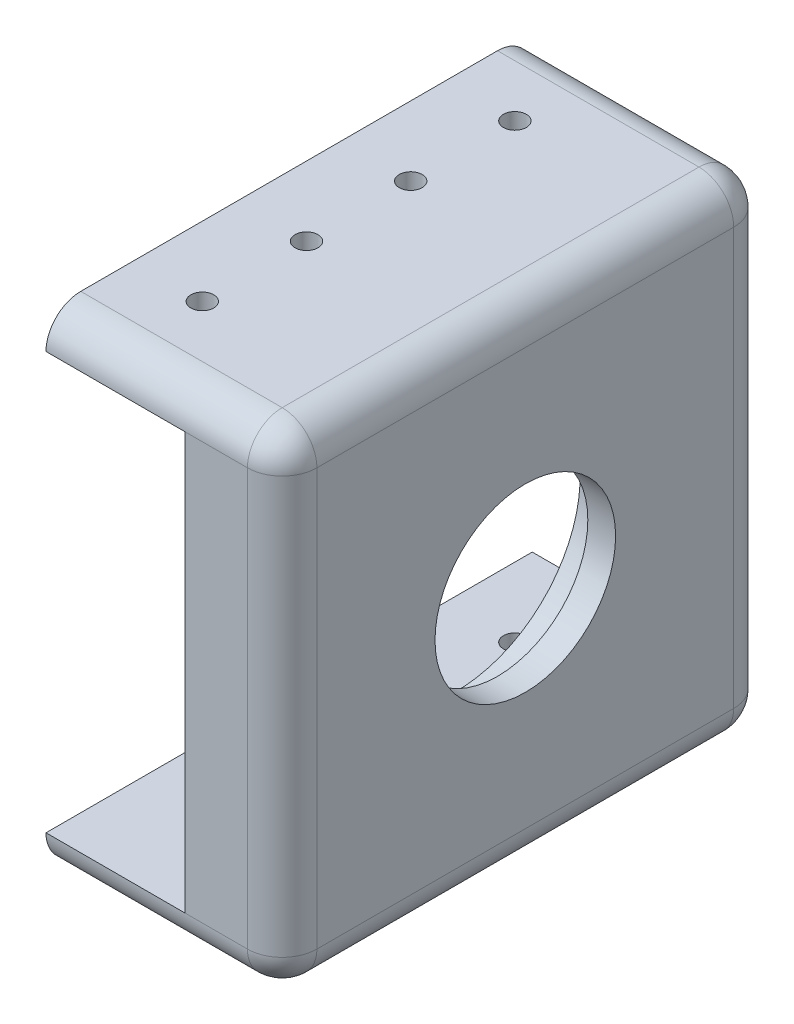
ISO-10303-21;
HEADER;
FILE_DESCRIPTION(('STEP AP214'),'2;1');
FILE_NAME('part.step','',(''),(''),'','','');
FILE_SCHEMA(('AUTOMOTIVE_DESIGN { 1 0 10303 214 1 1 1 1 }'));
ENDSEC;
DATA;
#1=APPLICATION_CONTEXT('core data for automotive mechanical design processes');
#2=APPLICATION_PROTOCOL_DEFINITION('international standard','automotive_design',2000,#1);
#3=PRODUCT_CONTEXT('',#1,'mechanical');
#4=PRODUCT('Part','Part','',(#3));
#5=PRODUCT_RELATED_PRODUCT_CATEGORY('part','',(#4));
#6=PRODUCT_DEFINITION_FORMATION('','',#4);
#7=PRODUCT_DEFINITION_CONTEXT('part definition',#1,'design');
#8=PRODUCT_DEFINITION('design','',#6,#7);
#9=PRODUCT_DEFINITION_SHAPE('','',#8);
#10=(LENGTH_UNIT() NAMED_UNIT(*) SI_UNIT(.MILLI.,.METRE.));
#11=(NAMED_UNIT(*) PLANE_ANGLE_UNIT() SI_UNIT($,.RADIAN.));
#12=(NAMED_UNIT(*) SI_UNIT($,.STERADIAN.) SOLID_ANGLE_UNIT());
#13=UNCERTAINTY_MEASURE_WITH_UNIT(LENGTH_MEASURE(1.E-05),#10,'distance_accuracy_value','');
#14=(GEOMETRIC_REPRESENTATION_CONTEXT(3) GLOBAL_UNCERTAINTY_ASSIGNED_CONTEXT((#13)) GLOBAL_UNIT_ASSIGNED_CONTEXT((#10,
#11,#12)) REPRESENTATION_CONTEXT('',''));
#15=CARTESIAN_POINT('',(0.,0.,0.));
#16=DIRECTION('',(0.,0.,1.));
#17=DIRECTION('',(1.,0.,0.));
#18=AXIS2_PLACEMENT_3D('',#15,#16,#17);
#19=CARTESIAN_POINT('',(30.,0.,35.));
#20=DIRECTION('',(-1.,0.,0.));
#21=DIRECTION('',(0.,0.,1.));
#22=AXIS2_PLACEMENT_3D('',#19,#20,#21);
#23=CYLINDRICAL_SURFACE('',#22,17.5);
#24=CARTESIAN_POINT('',(30.,0.,35.));
#25=DIRECTION('',(-1.,0.,0.));
#26=DIRECTION('',(0.,0.,1.));
#27=AXIS2_PLACEMENT_3D('',#24,#25,#26);
#28=CIRCLE('',#27,17.5);
#29=CARTESIAN_POINT('',(30.,0.,52.5));
#30=VERTEX_POINT('',#29);
#31=EDGE_CURVE('E718',#30,#30,#28,.T.);
#32=ORIENTED_EDGE('',*,*,#31,.F.);
#33=EDGE_LOOP('',(#32));
#34=FACE_BOUND('',#33,.T.);
#35=CARTESIAN_POINT('',(29.,0.,35.));
#36=DIRECTION('',(-1.,0.,0.));
#37=DIRECTION('',(0.,0.,1.));
#38=AXIS2_PLACEMENT_3D('',#35,#36,#37);
#39=CIRCLE('',#38,17.5);
#40=CARTESIAN_POINT('',(29.,0.,52.5));
#41=VERTEX_POINT('',#40);
#42=EDGE_CURVE('E47',#41,#41,#39,.F.);
#43=ORIENTED_EDGE('',*,*,#42,.F.);
#44=EDGE_LOOP('',(#43));
#45=FACE_BOUND('',#44,.T.);
#46=ADVANCED_FACE('F43',(#34,#45),#23,.F.);
#47=CARTESIAN_POINT('',(0.,-35.,70.));
#48=DIRECTION('',(0.,1.,0.));
#49=DIRECTION('',(0.,0.,1.));
#50=AXIS2_PLACEMENT_3D('',#47,#48,#49);
#51=PLANE('',#50);
#52=CARTESIAN_POINT('',(10.,-35.,42.5));
#53=DIRECTION('',(0.,-1.,0.));
#54=DIRECTION('',(0.,0.,-1.));
#55=AXIS2_PLACEMENT_3D('',#52,#53,#54);
#56=CIRCLE('',#55,1.64999999999999);
#57=CARTESIAN_POINT('',(10.,-35.,40.85));
#58=VERTEX_POINT('',#57);
#59=EDGE_CURVE('E751',#58,#58,#56,.T.);
#60=ORIENTED_EDGE('',*,*,#59,.F.);
#61=EDGE_LOOP('',(#60));
#62=FACE_BOUND('',#61,.T.);
#63=CARTESIAN_POINT('',(10.,-35.,57.5));
#64=DIRECTION('',(0.,-1.,0.));
#65=DIRECTION('',(0.,0.,-1.));
#66=AXIS2_PLACEMENT_3D('',#63,#64,#65);
#67=CIRCLE('',#66,1.64999999999999);
#68=CARTESIAN_POINT('',(10.,-35.,55.85));
#69=VERTEX_POINT('',#68);
#70=EDGE_CURVE('E759',#69,#69,#67,.T.);
#71=ORIENTED_EDGE('',*,*,#70,.F.);
#72=EDGE_LOOP('',(#71));
#73=FACE_BOUND('',#72,.T.);
#74=DIRECTION('',(1.,0.,0.));
#75=VECTOR('',#74,1.);
#76=CARTESIAN_POINT('',(0.,-35.,5.));
#77=LINE('',#76,#75);
#78=CARTESIAN_POINT('',(0.,-35.,5.));
#79=VERTEX_POINT('',#78);
#80=CARTESIAN_POINT('',(29.,-35.,5.));
#81=VERTEX_POINT('',#80);
#82=EDGE_CURVE('E147',#79,#81,#77,.T.);
#83=ORIENTED_EDGE('',*,*,#82,.T.);
#84=DIRECTION('',(0.,0.,-1.));
#85=VECTOR('',#84,1.);
#86=CARTESIAN_POINT('',(29.,-35.,70.));
#87=LINE('',#86,#85);
#88=CARTESIAN_POINT('',(29.,-35.,65.));
#89=VERTEX_POINT('',#88);
#90=EDGE_CURVE('E259',#81,#89,#87,.F.);
#91=ORIENTED_EDGE('',*,*,#90,.T.);
#92=DIRECTION('',(1.,0.,0.));
#93=VECTOR('',#92,1.);
#94=CARTESIAN_POINT('',(0.,-35.,65.));
#95=LINE('',#94,#93);
#96=CARTESIAN_POINT('',(0.,-35.,65.));
#97=VERTEX_POINT('',#96);
#98=EDGE_CURVE('E213',#89,#97,#95,.F.);
#99=ORIENTED_EDGE('',*,*,#98,.T.);
#100=DIRECTION('',(0.,0.,-1.));
#101=VECTOR('',#100,1.);
#102=CARTESIAN_POINT('',(0.,-35.,70.));
#103=LINE('',#102,#101);
#104=EDGE_CURVE('E202',#97,#79,#103,.T.);
#105=ORIENTED_EDGE('',*,*,#104,.T.);
#106=EDGE_LOOP('',(#83,#91,#99,#105));
#107=FACE_BOUND('',#106,.T.);
#108=CARTESIAN_POINT('',(10.,-35.,27.5));
#109=DIRECTION('',(0.,-1.,0.));
#110=DIRECTION('',(0.,0.,-1.));
#111=AXIS2_PLACEMENT_3D('',#108,#109,#110);
#112=CIRCLE('',#111,1.64999999999999);
#113=CARTESIAN_POINT('',(10.,-35.,25.85));
#114=VERTEX_POINT('',#113);
#115=EDGE_CURVE('E743',#114,#114,#112,.T.);
#116=ORIENTED_EDGE('',*,*,#115,.F.);
#117=EDGE_LOOP('',(#116));
#118=FACE_BOUND('',#117,.T.);
#119=CARTESIAN_POINT('',(10.,-35.,12.5));
#120=DIRECTION('',(0.,-1.,0.));
#121=DIRECTION('',(0.,0.,-1.));
#122=AXIS2_PLACEMENT_3D('',#119,#120,#121);
#123=CIRCLE('',#122,1.64999999999999);
#124=CARTESIAN_POINT('',(10.,-35.,10.85));
#125=VERTEX_POINT('',#124);
#126=EDGE_CURVE('E732',#125,#125,#123,.T.);
#127=ORIENTED_EDGE('',*,*,#126,.F.);
#128=EDGE_LOOP('',(#127));
#129=FACE_BOUND('',#128,.T.);
#130=ADVANCED_FACE('F349',(#62,#73,#107,#118,#129),#51,.F.);
#131=CARTESIAN_POINT('',(20.,0.,70.));
#132=DIRECTION('',(-1.,0.,0.));
#133=DIRECTION('',(0.,0.,1.));
#134=AXIS2_PLACEMENT_3D('',#131,#132,#133);
#135=PLANE('',#134);
#136=CARTESIAN_POINT('',(20.,0.,35.));
#137=DIRECTION('',(-1.,0.,0.));
#138=DIRECTION('',(0.,0.,1.));
#139=AXIS2_PLACEMENT_3D('',#136,#137,#138);
#140=CIRCLE('',#139,25.);
#141=CARTESIAN_POINT('',(20.,0.,60.));
#142=VERTEX_POINT('',#141);
#143=EDGE_CURVE('E727',#142,#142,#140,.T.);
#144=ORIENTED_EDGE('',*,*,#143,.F.);
#145=EDGE_LOOP('',(#144));
#146=FACE_BOUND('',#145,.T.);
#147=DIRECTION('',(0.,1.,0.));
#148=VECTOR('',#147,1.);
#149=CARTESIAN_POINT('',(20.,0.,0.));
#150=LINE('',#149,#148);
#151=CARTESIAN_POINT('',(20.,-30.,0.));
#152=VERTEX_POINT('',#151);
#153=CARTESIAN_POINT('',(20.,30.,0.));
#154=VERTEX_POINT('',#153);
#155=EDGE_CURVE('E160',#152,#154,#150,.T.);
#156=ORIENTED_EDGE('',*,*,#155,.F.);
#157=DIRECTION('',(0.,0.,-1.));
#158=VECTOR('',#157,1.);
#159=CARTESIAN_POINT('',(20.,-30.,70.));
#160=LINE('',#159,#158);
#161=CARTESIAN_POINT('',(20.,-30.,70.));
#162=VERTEX_POINT('',#161);
#163=EDGE_CURVE('E154',#162,#152,#160,.T.);
#164=ORIENTED_EDGE('',*,*,#163,.F.);
#165=DIRECTION('',(0.,1.,0.));
#166=VECTOR('',#165,1.);
#167=CARTESIAN_POINT('',(20.,0.,70.));
#168=LINE('',#167,#166);
#169=CARTESIAN_POINT('',(20.,30.,70.));
#170=VERTEX_POINT('',#169);
#171=EDGE_CURVE('E157',#162,#170,#168,.T.);
#172=ORIENTED_EDGE('',*,*,#171,.T.);
#173=DIRECTION('',(0.,0.,-1.));
#174=VECTOR('',#173,1.);
#175=CARTESIAN_POINT('',(20.,30.,70.));
#176=LINE('',#175,#174);
#177=EDGE_CURVE('E179',#170,#154,#176,.T.);
#178=ORIENTED_EDGE('',*,*,#177,.T.);
#179=EDGE_LOOP('',(#156,#164,#172,#178));
#180=FACE_BOUND('',#179,.T.);
#181=ADVANCED_FACE('F155',(#146,#180),#135,.T.);
#182=CARTESIAN_POINT('',(0.,-30.,70.));
#183=DIRECTION('',(0.,1.,0.));
#184=DIRECTION('',(0.,0.,1.));
#185=AXIS2_PLACEMENT_3D('',#182,#183,#184);
#186=PLANE('',#185);
#187=CARTESIAN_POINT('',(10.,-30.,12.5));
#188=DIRECTION('',(0.,1.,0.));
#189=DIRECTION('',(0.,0.,1.));
#190=AXIS2_PLACEMENT_3D('',#187,#188,#189);
#191=CIRCLE('',#190,1.64999999999999);
#192=CARTESIAN_POINT('',(10.,-30.,14.15));
#193=VERTEX_POINT('',#192);
#194=EDGE_CURVE('E739',#193,#193,#191,.T.);
#195=ORIENTED_EDGE('',*,*,#194,.F.);
#196=EDGE_LOOP('',(#195));
#197=FACE_BOUND('',#196,.T.);
#198=CARTESIAN_POINT('',(10.,-30.,27.5));
#199=DIRECTION('',(0.,1.,0.));
#200=DIRECTION('',(0.,0.,1.));
#201=AXIS2_PLACEMENT_3D('',#198,#199,#200);
#202=CIRCLE('',#201,1.64999999999999);
#203=CARTESIAN_POINT('',(10.,-30.,29.15));
#204=VERTEX_POINT('',#203);
#205=EDGE_CURVE('E747',#204,#204,#202,.T.);
#206=ORIENTED_EDGE('',*,*,#205,.F.);
#207=EDGE_LOOP('',(#206));
#208=FACE_BOUND('',#207,.T.);
#209=CARTESIAN_POINT('',(10.,-30.,42.5));
#210=DIRECTION('',(0.,1.,0.));
#211=DIRECTION('',(0.,0.,1.));
#212=AXIS2_PLACEMENT_3D('',#209,#210,#211);
#213=CIRCLE('',#212,1.64999999999999);
#214=CARTESIAN_POINT('',(10.,-30.,44.15));
#215=VERTEX_POINT('',#214);
#216=EDGE_CURVE('E755',#215,#215,#213,.T.);
#217=ORIENTED_EDGE('',*,*,#216,.F.);
#218=EDGE_LOOP('',(#217));
#219=FACE_BOUND('',#218,.T.);
#220=CARTESIAN_POINT('',(10.,-30.,57.5));
#221=DIRECTION('',(0.,1.,0.));
#222=DIRECTION('',(0.,0.,1.));
#223=AXIS2_PLACEMENT_3D('',#220,#221,#222);
#224=CIRCLE('',#223,1.64999999999999);
#225=CARTESIAN_POINT('',(10.,-30.,59.15));
#226=VERTEX_POINT('',#225);
#227=EDGE_CURVE('E763',#226,#226,#224,.T.);
#228=ORIENTED_EDGE('',*,*,#227,.F.);
#229=EDGE_LOOP('',(#228));
#230=FACE_BOUND('',#229,.T.);
#231=DIRECTION('',(1.,0.,0.));
#232=VECTOR('',#231,1.);
#233=CARTESIAN_POINT('',(0.,-30.,0.));
#234=LINE('',#233,#232);
#235=CARTESIAN_POINT('',(0.,-30.,0.));
#236=VERTEX_POINT('',#235);
#237=EDGE_CURVE('E185',#236,#152,#234,.T.);
#238=ORIENTED_EDGE('',*,*,#237,.F.);
#239=DIRECTION('',(0.,0.,-1.));
#240=VECTOR('',#239,1.);
#241=CARTESIAN_POINT('',(0.,-30.,70.));
#242=LINE('',#241,#240);
#243=CARTESIAN_POINT('',(0.,-30.,70.));
#244=VERTEX_POINT('',#243);
#245=EDGE_CURVE('E165',#244,#236,#242,.T.);
#246=ORIENTED_EDGE('',*,*,#245,.F.);
#247=DIRECTION('',(1.,0.,0.));
#248=VECTOR('',#247,1.);
#249=CARTESIAN_POINT('',(0.,-30.,70.));
#250=LINE('',#249,#248);
#251=EDGE_CURVE('E140',#244,#162,#250,.T.);
#252=ORIENTED_EDGE('',*,*,#251,.T.);
#253=ORIENTED_EDGE('',*,*,#163,.T.);
#254=EDGE_LOOP('',(#238,#246,#252,#253));
#255=FACE_BOUND('',#254,.T.);
#256=ADVANCED_FACE('F174',(#197,#208,#219,#230,#255),#186,.T.);
#257=CARTESIAN_POINT('',(0.,0.,70.));
#258=DIRECTION('',(-1.,0.,0.));
#259=DIRECTION('',(0.,0.,1.));
#260=AXIS2_PLACEMENT_3D('',#257,#258,#259);
#261=PLANE('',#260);
#262=ORIENTED_EDGE('',*,*,#104,.F.);
#263=CARTESIAN_POINT('',(0.,-30.,65.));
#264=DIRECTION('',(-1.,0.,0.));
#265=DIRECTION('',(0.,0.,1.));
#266=AXIS2_PLACEMENT_3D('',#263,#264,#265);
#267=CIRCLE('',#266,5.);
#268=EDGE_CURVE('E219',#97,#244,#267,.T.);
#269=ORIENTED_EDGE('',*,*,#268,.T.);
#270=ORIENTED_EDGE('',*,*,#245,.T.);
#271=CARTESIAN_POINT('',(0.,-30.,5.));
#272=DIRECTION('',(-1.,0.,0.));
#273=DIRECTION('',(0.,0.,1.));
#274=AXIS2_PLACEMENT_3D('',#271,#272,#273);
#275=CIRCLE('',#274,5.);
#276=EDGE_CURVE('E216',#236,#79,#275,.T.);
#277=ORIENTED_EDGE('',*,*,#276,.T.);
#278=EDGE_LOOP('',(#262,#269,#270,#277));
#279=FACE_BOUND('',#278,.T.);
#280=ADVANCED_FACE('F433',(#279),#261,.T.);
#281=CARTESIAN_POINT('',(34.,0.,70.));
#282=DIRECTION('',(-1.,0.,0.));
#283=DIRECTION('',(0.,0.,1.));
#284=AXIS2_PLACEMENT_3D('',#281,#282,#283);
#285=PLANE('',#284);
#286=CARTESIAN_POINT('',(34.,0.,35.));
#287=DIRECTION('',(-1.,0.,0.));
#288=DIRECTION('',(0.,0.,1.));
#289=AXIS2_PLACEMENT_3D('',#286,#287,#288);
#290=CIRCLE('',#289,13.);
#291=CARTESIAN_POINT('',(34.,0.,48.));
#292=VERTEX_POINT('',#291);
#293=EDGE_CURVE('E712',#292,#292,#290,.T.);
#294=ORIENTED_EDGE('',*,*,#293,.T.);
#295=EDGE_LOOP('',(#294));
#296=FACE_BOUND('',#295,.T.);
#297=DIRECTION('',(0.,1.,0.));
#298=VECTOR('',#297,1.);
#299=CARTESIAN_POINT('',(34.,-30.,65.));
#300=LINE('',#299,#298);
#301=CARTESIAN_POINT('',(34.,30.,65.));
#302=VERTEX_POINT('',#301);
#303=CARTESIAN_POINT('',(34.,-30.,65.));
#304=VERTEX_POINT('',#303);
#305=EDGE_CURVE('E252',#302,#304,#300,.F.);
#306=ORIENTED_EDGE('',*,*,#305,.T.);
#307=DIRECTION('',(0.,0.,-1.));
#308=VECTOR('',#307,1.);
#309=CARTESIAN_POINT('',(34.,-30.,70.));
#310=LINE('',#309,#308);
#311=CARTESIAN_POINT('',(34.,-30.,5.));
#312=VERTEX_POINT('',#311);
#313=EDGE_CURVE('E255',#304,#312,#310,.T.);
#314=ORIENTED_EDGE('',*,*,#313,.T.);
#315=DIRECTION('',(0.,1.,0.));
#316=VECTOR('',#315,1.);
#317=CARTESIAN_POINT('',(34.,0.,5.));
#318=LINE('',#317,#316);
#319=CARTESIAN_POINT('',(34.,30.,5.));
#320=VERTEX_POINT('',#319);
#321=EDGE_CURVE('E249',#312,#320,#318,.T.);
#322=ORIENTED_EDGE('',*,*,#321,.T.);
#323=DIRECTION('',(0.,0.,-1.));
#324=VECTOR('',#323,1.);
#325=CARTESIAN_POINT('',(34.,30.,65.));
#326=LINE('',#325,#324);
#327=EDGE_CURVE('E246',#320,#302,#326,.F.);
#328=ORIENTED_EDGE('',*,*,#327,.T.);
#329=EDGE_LOOP('',(#306,#314,#322,#328));
#330=FACE_BOUND('',#329,.T.);
#331=ADVANCED_FACE('F344',(#296,#330),#285,.F.);
#332=CARTESIAN_POINT('',(0.,35.,70.));
#333=DIRECTION('',(0.,1.,0.));
#334=DIRECTION('',(0.,0.,1.));
#335=AXIS2_PLACEMENT_3D('',#332,#333,#334);
#336=PLANE('',#335);
#337=CARTESIAN_POINT('',(10.,35.,12.5));
#338=DIRECTION('',(0.,1.,0.));
#339=DIRECTION('',(0.,0.,1.));
#340=AXIS2_PLACEMENT_3D('',#337,#338,#339);
#341=CIRCLE('',#340,1.64999999999999);
#342=CARTESIAN_POINT('',(10.,35.,14.15));
#343=VERTEX_POINT('',#342);
#344=EDGE_CURVE('E767',#343,#343,#341,.T.);
#345=ORIENTED_EDGE('',*,*,#344,.F.);
#346=EDGE_LOOP('',(#345));
#347=FACE_BOUND('',#346,.T.);
#348=CARTESIAN_POINT('',(10.,35.,27.5));
#349=DIRECTION('',(0.,1.,0.));
#350=DIRECTION('',(0.,0.,1.));
#351=AXIS2_PLACEMENT_3D('',#348,#349,#350);
#352=CIRCLE('',#351,1.64999999999999);
#353=CARTESIAN_POINT('',(10.,35.,29.15));
#354=VERTEX_POINT('',#353);
#355=EDGE_CURVE('E775',#354,#354,#352,.T.);
#356=ORIENTED_EDGE('',*,*,#355,.F.);
#357=EDGE_LOOP('',(#356));
#358=FACE_BOUND('',#357,.T.);
#359=CARTESIAN_POINT('',(10.,35.,42.5));
#360=DIRECTION('',(0.,1.,0.));
#361=DIRECTION('',(0.,0.,1.));
#362=AXIS2_PLACEMENT_3D('',#359,#360,#361);
#363=CIRCLE('',#362,1.64999999999999);
#364=CARTESIAN_POINT('',(10.,35.,44.15));
#365=VERTEX_POINT('',#364);
#366=EDGE_CURVE('E783',#365,#365,#363,.T.);
#367=ORIENTED_EDGE('',*,*,#366,.F.);
#368=EDGE_LOOP('',(#367));
#369=FACE_BOUND('',#368,.T.);
#370=CARTESIAN_POINT('',(10.,35.,57.5));
#371=DIRECTION('',(0.,1.,0.));
#372=DIRECTION('',(0.,0.,1.));
#373=AXIS2_PLACEMENT_3D('',#370,#371,#372);
#374=CIRCLE('',#373,1.64999999999999);
#375=CARTESIAN_POINT('',(10.,35.,59.15));
#376=VERTEX_POINT('',#375);
#377=EDGE_CURVE('E791',#376,#376,#374,.T.);
#378=ORIENTED_EDGE('',*,*,#377,.F.);
#379=EDGE_LOOP('',(#378));
#380=FACE_BOUND('',#379,.T.);
#381=DIRECTION('',(1.,0.,0.));
#382=VECTOR('',#381,1.);
#383=CARTESIAN_POINT('',(0.,35.,65.));
#384=LINE('',#383,#382);
#385=CARTESIAN_POINT('',(0.,35.,65.));
#386=VERTEX_POINT('',#385);
#387=CARTESIAN_POINT('',(29.,35.,65.));
#388=VERTEX_POINT('',#387);
#389=EDGE_CURVE('E228',#386,#388,#384,.T.);
#390=ORIENTED_EDGE('',*,*,#389,.T.);
#391=DIRECTION('',(0.,0.,-1.));
#392=VECTOR('',#391,1.);
#393=CARTESIAN_POINT('',(29.,35.,5.));
#394=LINE('',#393,#392);
#395=CARTESIAN_POINT('',(29.,35.,5.));
#396=VERTEX_POINT('',#395);
#397=EDGE_CURVE('E11',#388,#396,#394,.T.);
#398=ORIENTED_EDGE('',*,*,#397,.T.);
#399=DIRECTION('',(1.,0.,0.));
#400=VECTOR('',#399,1.);
#401=CARTESIAN_POINT('',(0.,35.,5.));
#402=LINE('',#401,#400);
#403=CARTESIAN_POINT('',(0.,35.,5.));
#404=VERTEX_POINT('',#403);
#405=EDGE_CURVE('E231',#396,#404,#402,.F.);
#406=ORIENTED_EDGE('',*,*,#405,.T.);
#407=DIRECTION('',(0.,0.,-1.));
#408=VECTOR('',#407,1.);
#409=CARTESIAN_POINT('',(0.,35.,70.));
#410=LINE('',#409,#408);
#411=EDGE_CURVE('E198',#386,#404,#410,.T.);
#412=ORIENTED_EDGE('',*,*,#411,.F.);
#413=EDGE_LOOP('',(#390,#398,#406,#412));
#414=FACE_BOUND('',#413,.T.);
#415=ADVANCED_FACE('F313',(#347,#358,#369,#380,#414),#336,.T.);
#416=ORIENTED_EDGE('',*,*,#411,.T.);
#417=CARTESIAN_POINT('',(0.,30.,5.));
#418=DIRECTION('',(-1.,0.,0.));
#419=DIRECTION('',(0.,0.,1.));
#420=AXIS2_PLACEMENT_3D('',#417,#418,#419);
#421=CIRCLE('',#420,5.);
#422=CARTESIAN_POINT('',(0.,30.,0.));
#423=VERTEX_POINT('',#422);
#424=EDGE_CURVE('E237',#404,#423,#421,.T.);
#425=ORIENTED_EDGE('',*,*,#424,.T.);
#426=DIRECTION('',(0.,0.,-1.));
#427=VECTOR('',#426,1.);
#428=CARTESIAN_POINT('',(0.,30.,70.));
#429=LINE('',#428,#427);
#430=CARTESIAN_POINT('',(0.,30.,70.));
#431=VERTEX_POINT('',#430);
#432=EDGE_CURVE('E194',#431,#423,#429,.T.);
#433=ORIENTED_EDGE('',*,*,#432,.F.);
#434=CARTESIAN_POINT('',(0.,30.,65.));
#435=DIRECTION('',(-1.,0.,0.));
#436=DIRECTION('',(0.,0.,1.));
#437=AXIS2_PLACEMENT_3D('',#434,#435,#436);
#438=CIRCLE('',#437,5.);
#439=EDGE_CURVE('E234',#431,#386,#438,.T.);
#440=ORIENTED_EDGE('',*,*,#439,.T.);
#441=EDGE_LOOP('',(#416,#425,#433,#440));
#442=FACE_BOUND('',#441,.T.);
#443=ADVANCED_FACE('F316',(#442),#261,.T.);
#444=CARTESIAN_POINT('',(0.,30.,70.));
#445=DIRECTION('',(0.,1.,0.));
#446=DIRECTION('',(0.,0.,1.));
#447=AXIS2_PLACEMENT_3D('',#444,#445,#446);
#448=PLANE('',#447);
#449=CARTESIAN_POINT('',(10.,30.,12.5));
#450=DIRECTION('',(0.,1.,0.));
#451=DIRECTION('',(0.,0.,1.));
#452=AXIS2_PLACEMENT_3D('',#449,#450,#451);
#453=CIRCLE('',#452,1.64999999999999);
#454=CARTESIAN_POINT('',(10.,30.,14.15));
#455=VERTEX_POINT('',#454);
#456=EDGE_CURVE('E771',#455,#455,#453,.T.);
#457=ORIENTED_EDGE('',*,*,#456,.T.);
#458=EDGE_LOOP('',(#457));
#459=FACE_BOUND('',#458,.T.);
#460=CARTESIAN_POINT('',(10.,30.,27.5));
#461=DIRECTION('',(0.,1.,0.));
#462=DIRECTION('',(0.,0.,1.));
#463=AXIS2_PLACEMENT_3D('',#460,#461,#462);
#464=CIRCLE('',#463,1.64999999999999);
#465=CARTESIAN_POINT('',(10.,30.,29.15));
#466=VERTEX_POINT('',#465);
#467=EDGE_CURVE('E779',#466,#466,#464,.T.);
#468=ORIENTED_EDGE('',*,*,#467,.T.);
#469=EDGE_LOOP('',(#468));
#470=FACE_BOUND('',#469,.T.);
#471=CARTESIAN_POINT('',(10.,30.,42.5));
#472=DIRECTION('',(0.,1.,0.));
#473=DIRECTION('',(0.,0.,1.));
#474=AXIS2_PLACEMENT_3D('',#471,#472,#473);
#475=CIRCLE('',#474,1.64999999999999);
#476=CARTESIAN_POINT('',(10.,30.,44.15));
#477=VERTEX_POINT('',#476);
#478=EDGE_CURVE('E787',#477,#477,#475,.T.);
#479=ORIENTED_EDGE('',*,*,#478,.T.);
#480=EDGE_LOOP('',(#479));
#481=FACE_BOUND('',#480,.T.);
#482=CARTESIAN_POINT('',(10.,30.,57.5));
#483=DIRECTION('',(0.,1.,0.));
#484=DIRECTION('',(0.,0.,1.));
#485=AXIS2_PLACEMENT_3D('',#482,#483,#484);
#486=CIRCLE('',#485,1.64999999999999);
#487=CARTESIAN_POINT('',(10.,30.,59.15));
#488=VERTEX_POINT('',#487);
#489=EDGE_CURVE('E276',#488,#488,#486,.T.);
#490=ORIENTED_EDGE('',*,*,#489,.T.);
#491=EDGE_LOOP('',(#490));
#492=FACE_BOUND('',#491,.T.);
#493=DIRECTION('',(1.,0.,0.));
#494=VECTOR('',#493,1.);
#495=CARTESIAN_POINT('',(0.,30.,0.));
#496=LINE('',#495,#494);
#497=EDGE_CURVE('E171',#423,#154,#496,.T.);
#498=ORIENTED_EDGE('',*,*,#497,.T.);
#499=ORIENTED_EDGE('',*,*,#177,.F.);
#500=DIRECTION('',(1.,0.,0.));
#501=VECTOR('',#500,1.);
#502=CARTESIAN_POINT('',(0.,30.,70.));
#503=LINE('',#502,#501);
#504=EDGE_CURVE('E176',#431,#170,#503,.T.);
#505=ORIENTED_EDGE('',*,*,#504,.F.);
#506=ORIENTED_EDGE('',*,*,#432,.T.);
#507=EDGE_LOOP('',(#498,#499,#505,#506));
#508=FACE_BOUND('',#507,.T.);
#509=ADVANCED_FACE('F321',(#459,#470,#481,#492,#508),#448,.F.);
#510=CARTESIAN_POINT('',(0.,0.,70.));
#511=DIRECTION('',(0.,0.,1.));
#512=DIRECTION('',(1.,0.,0.));
#513=AXIS2_PLACEMENT_3D('',#510,#511,#512);
#514=PLANE('',#513);
#515=DIRECTION('',(1.,0.,0.));
#516=VECTOR('',#515,1.);
#517=CARTESIAN_POINT('',(34.,-30.,70.));
#518=LINE('',#517,#516);
#519=CARTESIAN_POINT('',(29.,-30.,70.));
#520=VERTEX_POINT('',#519);
#521=EDGE_CURVE('E134',#162,#520,#518,.T.);
#522=ORIENTED_EDGE('',*,*,#521,.T.);
#523=DIRECTION('',(0.,1.,0.));
#524=VECTOR('',#523,1.);
#525=CARTESIAN_POINT('',(29.,30.,70.));
#526=LINE('',#525,#524);
#527=CARTESIAN_POINT('',(29.,30.,70.));
#528=VERTEX_POINT('',#527);
#529=EDGE_CURVE('E265',#520,#528,#526,.T.);
#530=ORIENTED_EDGE('',*,*,#529,.T.);
#531=DIRECTION('',(1.,0.,0.));
#532=VECTOR('',#531,1.);
#533=CARTESIAN_POINT('',(0.,30.,70.));
#534=LINE('',#533,#532);
#535=EDGE_CURVE('E148',#528,#170,#534,.F.);
#536=ORIENTED_EDGE('',*,*,#535,.T.);
#537=ORIENTED_EDGE('',*,*,#171,.F.);
#538=EDGE_LOOP('',(#522,#530,#536,#537));
#539=FACE_BOUND('',#538,.T.);
#540=ADVANCED_FACE('F167',(#539),#514,.T.);
#541=CARTESIAN_POINT('',(0.,0.,0.));
#542=DIRECTION('',(0.,0.,1.));
#543=DIRECTION('',(1.,0.,0.));
#544=AXIS2_PLACEMENT_3D('',#541,#542,#543);
#545=PLANE('',#544);
#546=DIRECTION('',(1.,0.,0.));
#547=VECTOR('',#546,1.);
#548=CARTESIAN_POINT('',(34.,30.,0.));
#549=LINE('',#548,#547);
#550=CARTESIAN_POINT('',(29.,30.,0.));
#551=VERTEX_POINT('',#550);
#552=EDGE_CURVE('E222',#154,#551,#549,.T.);
#553=ORIENTED_EDGE('',*,*,#552,.T.);
#554=DIRECTION('',(0.,1.,0.));
#555=VECTOR('',#554,1.);
#556=CARTESIAN_POINT('',(29.,0.,0.));
#557=LINE('',#556,#555);
#558=CARTESIAN_POINT('',(29.,-30.,0.));
#559=VERTEX_POINT('',#558);
#560=EDGE_CURVE('E53',#551,#559,#557,.F.);
#561=ORIENTED_EDGE('',*,*,#560,.T.);
#562=DIRECTION('',(1.,0.,0.));
#563=VECTOR('',#562,1.);
#564=CARTESIAN_POINT('',(0.,-30.,0.));
#565=LINE('',#564,#563);
#566=EDGE_CURVE('E225',#559,#152,#565,.F.);
#567=ORIENTED_EDGE('',*,*,#566,.T.);
#568=ORIENTED_EDGE('',*,*,#155,.T.);
#569=EDGE_LOOP('',(#553,#561,#567,#568));
#570=FACE_BOUND('',#569,.T.);
#571=ADVANCED_FACE('F324',(#570),#545,.F.);
#572=CARTESIAN_POINT('',(0.,-30.,65.));
#573=DIRECTION('',(-1.,0.,0.));
#574=DIRECTION('',(0.,0.,1.));
#575=AXIS2_PLACEMENT_3D('',#572,#573,#574);
#576=CYLINDRICAL_SURFACE('',#575,5.);
#577=ORIENTED_EDGE('',*,*,#98,.F.);
#578=CARTESIAN_POINT('',(29.,-30.,65.));
#579=DIRECTION('',(-1.,0.,0.));
#580=DIRECTION('',(0.,0.,1.));
#581=AXIS2_PLACEMENT_3D('',#578,#579,#580);
#582=CIRCLE('',#581,5.);
#583=EDGE_CURVE('E142',#89,#520,#582,.T.);
#584=ORIENTED_EDGE('',*,*,#583,.T.);
#585=ORIENTED_EDGE('',*,*,#521,.F.);
#586=ORIENTED_EDGE('',*,*,#251,.F.);
#587=ORIENTED_EDGE('',*,*,#268,.F.);
#588=EDGE_LOOP('',(#577,#584,#585,#586,#587));
#589=FACE_BOUND('',#588,.T.);
#590=ADVANCED_FACE('F137',(#589),#576,.T.);
#591=CARTESIAN_POINT('',(0.,-30.,5.));
#592=DIRECTION('',(1.,0.,0.));
#593=DIRECTION('',(0.,0.,-1.));
#594=AXIS2_PLACEMENT_3D('',#591,#592,#593);
#595=CYLINDRICAL_SURFACE('',#594,5.);
#596=ORIENTED_EDGE('',*,*,#566,.F.);
#597=CARTESIAN_POINT('',(29.,-30.,5.));
#598=DIRECTION('',(1.,0.,0.));
#599=DIRECTION('',(0.,0.,-1.));
#600=AXIS2_PLACEMENT_3D('',#597,#598,#599);
#601=CIRCLE('',#600,5.);
#602=EDGE_CURVE('E240',#559,#81,#601,.F.);
#603=ORIENTED_EDGE('',*,*,#602,.T.);
#604=ORIENTED_EDGE('',*,*,#82,.F.);
#605=ORIENTED_EDGE('',*,*,#276,.F.);
#606=ORIENTED_EDGE('',*,*,#237,.T.);
#607=EDGE_LOOP('',(#596,#603,#604,#605,#606));
#608=FACE_BOUND('',#607,.T.);
#609=ADVANCED_FACE('F330',(#608),#595,.T.);
#610=CARTESIAN_POINT('',(0.,30.,5.));
#611=DIRECTION('',(-1.,0.,0.));
#612=DIRECTION('',(0.,0.,1.));
#613=AXIS2_PLACEMENT_3D('',#610,#611,#612);
#614=CYLINDRICAL_SURFACE('',#613,5.);
#615=ORIENTED_EDGE('',*,*,#405,.F.);
#616=CARTESIAN_POINT('',(29.,30.,5.));
#617=DIRECTION('',(-1.,0.,0.));
#618=DIRECTION('',(0.,0.,1.));
#619=AXIS2_PLACEMENT_3D('',#616,#617,#618);
#620=CIRCLE('',#619,5.);
#621=EDGE_CURVE('E61',#396,#551,#620,.T.);
#622=ORIENTED_EDGE('',*,*,#621,.T.);
#623=ORIENTED_EDGE('',*,*,#552,.F.);
#624=ORIENTED_EDGE('',*,*,#497,.F.);
#625=ORIENTED_EDGE('',*,*,#424,.F.);
#626=EDGE_LOOP('',(#615,#622,#623,#624,#625));
#627=FACE_BOUND('',#626,.T.);
#628=ADVANCED_FACE('F318',(#627),#614,.T.);
#629=CARTESIAN_POINT('',(0.,30.,65.));
#630=DIRECTION('',(1.,0.,0.));
#631=DIRECTION('',(0.,0.,-1.));
#632=AXIS2_PLACEMENT_3D('',#629,#630,#631);
#633=CYLINDRICAL_SURFACE('',#632,5.);
#634=ORIENTED_EDGE('',*,*,#535,.F.);
#635=CARTESIAN_POINT('',(29.,30.,65.));
#636=DIRECTION('',(1.,0.,0.));
#637=DIRECTION('',(0.,0.,-1.));
#638=AXIS2_PLACEMENT_3D('',#635,#636,#637);
#639=CIRCLE('',#638,5.);
#640=EDGE_CURVE('E262',#528,#388,#639,.F.);
#641=ORIENTED_EDGE('',*,*,#640,.T.);
#642=ORIENTED_EDGE('',*,*,#389,.F.);
#643=ORIENTED_EDGE('',*,*,#439,.F.);
#644=ORIENTED_EDGE('',*,*,#504,.T.);
#645=EDGE_LOOP('',(#634,#641,#642,#643,#644));
#646=FACE_BOUND('',#645,.T.);
#647=ADVANCED_FACE('F310',(#646),#633,.T.);
#648=CARTESIAN_POINT('',(29.,30.,65.));
#649=DIRECTION('',(-1.,0.,0.));
#650=DIRECTION('',(0.,0.,1.));
#651=AXIS2_PLACEMENT_3D('',#648,#649,#650);
#652=SPHERICAL_SURFACE('',#651,5.);
#653=CARTESIAN_POINT('',(29.,30.,65.));
#654=DIRECTION('',(0.,0.,-1.));
#655=DIRECTION('',(-1.,0.,0.));
#656=AXIS2_PLACEMENT_3D('',#653,#654,#655);
#657=CIRCLE('',#656,5.);
#658=EDGE_CURVE('E295',#388,#302,#657,.T.);
#659=ORIENTED_EDGE('',*,*,#658,.F.);
#660=ORIENTED_EDGE('',*,*,#640,.F.);
#661=CARTESIAN_POINT('',(29.,30.,65.));
#662=DIRECTION('',(0.,-1.,0.));
#663=DIRECTION('',(0.,0.,-1.));
#664=AXIS2_PLACEMENT_3D('',#661,#662,#663);
#665=CIRCLE('',#664,5.);
#666=EDGE_CURVE('E186',#302,#528,#665,.T.);
#667=ORIENTED_EDGE('',*,*,#666,.F.);
#668=EDGE_LOOP('',(#659,#660,#667));
#669=FACE_BOUND('',#668,.T.);
#670=ADVANCED_FACE('F45',(#669),#652,.T.);
#671=CARTESIAN_POINT('',(29.,0.,65.));
#672=DIRECTION('',(0.,-1.,0.));
#673=DIRECTION('',(0.,0.,-1.));
#674=AXIS2_PLACEMENT_3D('',#671,#672,#673);
#675=CYLINDRICAL_SURFACE('',#674,5.);
#676=ORIENTED_EDGE('',*,*,#666,.T.);
#677=ORIENTED_EDGE('',*,*,#529,.F.);
#678=CARTESIAN_POINT('',(29.,-30.,65.));
#679=DIRECTION('',(0.,-1.,0.));
#680=DIRECTION('',(0.,0.,-1.));
#681=AXIS2_PLACEMENT_3D('',#678,#679,#680);
#682=CIRCLE('',#681,5.);
#683=EDGE_CURVE('E291',#304,#520,#682,.T.);
#684=ORIENTED_EDGE('',*,*,#683,.F.);
#685=ORIENTED_EDGE('',*,*,#305,.F.);
#686=EDGE_LOOP('',(#676,#677,#684,#685));
#687=FACE_BOUND('',#686,.T.);
#688=ADVANCED_FACE('F303',(#687),#675,.T.);
#689=CARTESIAN_POINT('',(29.,30.,70.));
#690=DIRECTION('',(0.,0.,1.));
#691=DIRECTION('',(1.,0.,0.));
#692=AXIS2_PLACEMENT_3D('',#689,#690,#691);
#693=CYLINDRICAL_SURFACE('',#692,5.);
#694=ORIENTED_EDGE('',*,*,#658,.T.);
#695=ORIENTED_EDGE('',*,*,#327,.F.);
#696=CARTESIAN_POINT('',(29.,30.,5.));
#697=DIRECTION('',(0.,0.,-1.));
#698=DIRECTION('',(-1.,0.,0.));
#699=AXIS2_PLACEMENT_3D('',#696,#697,#698);
#700=CIRCLE('',#699,5.);
#701=EDGE_CURVE('E287',#396,#320,#700,.T.);
#702=ORIENTED_EDGE('',*,*,#701,.F.);
#703=ORIENTED_EDGE('',*,*,#397,.F.);
#704=EDGE_LOOP('',(#694,#695,#702,#703));
#705=FACE_BOUND('',#704,.T.);
#706=ADVANCED_FACE('F356',(#705),#693,.T.);
#707=CARTESIAN_POINT('',(29.,-30.,65.));
#708=DIRECTION('',(-1.,0.,0.));
#709=DIRECTION('',(0.,0.,1.));
#710=AXIS2_PLACEMENT_3D('',#707,#708,#709);
#711=SPHERICAL_SURFACE('',#710,5.);
#712=ORIENTED_EDGE('',*,*,#683,.T.);
#713=ORIENTED_EDGE('',*,*,#583,.F.);
#714=CARTESIAN_POINT('',(29.,-30.,65.));
#715=DIRECTION('',(0.,0.,-1.));
#716=DIRECTION('',(-1.,0.,0.));
#717=AXIS2_PLACEMENT_3D('',#714,#715,#716);
#718=CIRCLE('',#717,5.);
#719=EDGE_CURVE('E283',#304,#89,#718,.T.);
#720=ORIENTED_EDGE('',*,*,#719,.F.);
#721=EDGE_LOOP('',(#712,#713,#720));
#722=FACE_BOUND('',#721,.T.);
#723=ADVANCED_FACE('F353',(#722),#711,.T.);
#724=CARTESIAN_POINT('',(29.,30.,5.));
#725=DIRECTION('',(-1.,0.,0.));
#726=DIRECTION('',(0.,0.,1.));
#727=AXIS2_PLACEMENT_3D('',#724,#725,#726);
#728=SPHERICAL_SURFACE('',#727,5.);
#729=ORIENTED_EDGE('',*,*,#621,.F.);
#730=ORIENTED_EDGE('',*,*,#701,.T.);
#731=CARTESIAN_POINT('',(29.,30.,5.));
#732=DIRECTION('',(0.,-1.,0.));
#733=DIRECTION('',(0.,0.,-1.));
#734=AXIS2_PLACEMENT_3D('',#731,#732,#733);
#735=CIRCLE('',#734,5.);
#736=EDGE_CURVE('E279',#551,#320,#735,.T.);
#737=ORIENTED_EDGE('',*,*,#736,.F.);
#738=EDGE_LOOP('',(#729,#730,#737));
#739=FACE_BOUND('',#738,.T.);
#740=ADVANCED_FACE('F355',(#739),#728,.T.);
#741=CARTESIAN_POINT('',(29.,-30.,70.));
#742=DIRECTION('',(0.,0.,-1.));
#743=DIRECTION('',(-1.,0.,0.));
#744=AXIS2_PLACEMENT_3D('',#741,#742,#743);
#745=CYLINDRICAL_SURFACE('',#744,5.);
#746=ORIENTED_EDGE('',*,*,#719,.T.);
#747=ORIENTED_EDGE('',*,*,#90,.F.);
#748=CARTESIAN_POINT('',(29.,-30.,5.));
#749=DIRECTION('',(0.,0.,-1.));
#750=DIRECTION('',(-1.,0.,0.));
#751=AXIS2_PLACEMENT_3D('',#748,#749,#750);
#752=CIRCLE('',#751,5.);
#753=EDGE_CURVE('E275',#312,#81,#752,.T.);
#754=ORIENTED_EDGE('',*,*,#753,.F.);
#755=ORIENTED_EDGE('',*,*,#313,.F.);
#756=EDGE_LOOP('',(#746,#747,#754,#755));
#757=FACE_BOUND('',#756,.T.);
#758=ADVANCED_FACE('F346',(#757),#745,.T.);
#759=CARTESIAN_POINT('',(29.,0.,5.));
#760=DIRECTION('',(0.,1.,0.));
#761=DIRECTION('',(0.,0.,1.));
#762=AXIS2_PLACEMENT_3D('',#759,#760,#761);
#763=CYLINDRICAL_SURFACE('',#762,5.);
#764=ORIENTED_EDGE('',*,*,#736,.T.);
#765=ORIENTED_EDGE('',*,*,#321,.F.);
#766=CARTESIAN_POINT('',(29.,-30.,5.));
#767=DIRECTION('',(0.,-1.,0.));
#768=DIRECTION('',(0.,0.,-1.));
#769=AXIS2_PLACEMENT_3D('',#766,#767,#768);
#770=CIRCLE('',#769,5.);
#771=EDGE_CURVE('E272',#559,#312,#770,.T.);
#772=ORIENTED_EDGE('',*,*,#771,.F.);
#773=ORIENTED_EDGE('',*,*,#560,.F.);
#774=EDGE_LOOP('',(#764,#765,#772,#773));
#775=FACE_BOUND('',#774,.T.);
#776=ADVANCED_FACE('F340',(#775),#763,.T.);
#777=CARTESIAN_POINT('',(29.,-30.,5.));
#778=DIRECTION('',(-1.,0.,0.));
#779=DIRECTION('',(0.,0.,1.));
#780=AXIS2_PLACEMENT_3D('',#777,#778,#779);
#781=SPHERICAL_SURFACE('',#780,5.);
#782=ORIENTED_EDGE('',*,*,#753,.T.);
#783=ORIENTED_EDGE('',*,*,#602,.F.);
#784=ORIENTED_EDGE('',*,*,#771,.T.);
#785=EDGE_LOOP('',(#782,#783,#784));
#786=FACE_BOUND('',#785,.T.);
#787=ADVANCED_FACE('F335',(#786),#781,.T.);
#788=CARTESIAN_POINT('',(10.,35.,57.5));
#789=DIRECTION('',(0.,1.,0.));
#790=DIRECTION('',(0.,0.,1.));
#791=AXIS2_PLACEMENT_3D('',#788,#789,#790);
#792=CYLINDRICAL_SURFACE('',#791,1.64999999999999);
#793=ORIENTED_EDGE('',*,*,#489,.F.);
#794=EDGE_LOOP('',(#793));
#795=FACE_BOUND('',#794,.T.);
#796=ORIENTED_EDGE('',*,*,#377,.T.);
#797=EDGE_LOOP('',(#796));
#798=FACE_BOUND('',#797,.T.);
#799=ADVANCED_FACE('F419',(#795,#798),#792,.F.);
#800=CARTESIAN_POINT('',(10.,35.,42.5));
#801=DIRECTION('',(0.,1.,0.));
#802=DIRECTION('',(0.,0.,1.));
#803=AXIS2_PLACEMENT_3D('',#800,#801,#802);
#804=CYLINDRICAL_SURFACE('',#803,1.64999999999999);
#805=ORIENTED_EDGE('',*,*,#478,.F.);
#806=EDGE_LOOP('',(#805));
#807=FACE_BOUND('',#806,.T.);
#808=ORIENTED_EDGE('',*,*,#366,.T.);
#809=EDGE_LOOP('',(#808));
#810=FACE_BOUND('',#809,.T.);
#811=ADVANCED_FACE('F415',(#807,#810),#804,.F.);
#812=CARTESIAN_POINT('',(10.,35.,27.5));
#813=DIRECTION('',(0.,1.,0.));
#814=DIRECTION('',(0.,0.,1.));
#815=AXIS2_PLACEMENT_3D('',#812,#813,#814);
#816=CYLINDRICAL_SURFACE('',#815,1.64999999999999);
#817=ORIENTED_EDGE('',*,*,#467,.F.);
#818=EDGE_LOOP('',(#817));
#819=FACE_BOUND('',#818,.T.);
#820=ORIENTED_EDGE('',*,*,#355,.T.);
#821=EDGE_LOOP('',(#820));
#822=FACE_BOUND('',#821,.T.);
#823=ADVANCED_FACE('F411',(#819,#822),#816,.F.);
#824=CARTESIAN_POINT('',(10.,35.,12.5));
#825=DIRECTION('',(0.,1.,0.));
#826=DIRECTION('',(0.,0.,1.));
#827=AXIS2_PLACEMENT_3D('',#824,#825,#826);
#828=CYLINDRICAL_SURFACE('',#827,1.64999999999999);
#829=ORIENTED_EDGE('',*,*,#456,.F.);
#830=EDGE_LOOP('',(#829));
#831=FACE_BOUND('',#830,.T.);
#832=ORIENTED_EDGE('',*,*,#344,.T.);
#833=EDGE_LOOP('',(#832));
#834=FACE_BOUND('',#833,.T.);
#835=ADVANCED_FACE('F407',(#831,#834),#828,.F.);
#836=CARTESIAN_POINT('',(10.,-35.,57.5));
#837=DIRECTION('',(0.,-1.,0.));
#838=DIRECTION('',(0.,0.,-1.));
#839=AXIS2_PLACEMENT_3D('',#836,#837,#838);
#840=CYLINDRICAL_SURFACE('',#839,1.64999999999999);
#841=ORIENTED_EDGE('',*,*,#70,.T.);
#842=EDGE_LOOP('',(#841));
#843=FACE_BOUND('',#842,.T.);
#844=ORIENTED_EDGE('',*,*,#227,.T.);
#845=EDGE_LOOP('',(#844));
#846=FACE_BOUND('',#845,.T.);
#847=ADVANCED_FACE('F403',(#843,#846),#840,.F.);
#848=CARTESIAN_POINT('',(10.,-35.,42.5));
#849=DIRECTION('',(0.,-1.,0.));
#850=DIRECTION('',(0.,0.,-1.));
#851=AXIS2_PLACEMENT_3D('',#848,#849,#850);
#852=CYLINDRICAL_SURFACE('',#851,1.64999999999999);
#853=ORIENTED_EDGE('',*,*,#59,.T.);
#854=EDGE_LOOP('',(#853));
#855=FACE_BOUND('',#854,.T.);
#856=ORIENTED_EDGE('',*,*,#216,.T.);
#857=EDGE_LOOP('',(#856));
#858=FACE_BOUND('',#857,.T.);
#859=ADVANCED_FACE('F399',(#855,#858),#852,.F.);
#860=CARTESIAN_POINT('',(10.,-35.,27.5));
#861=DIRECTION('',(0.,-1.,0.));
#862=DIRECTION('',(0.,0.,-1.));
#863=AXIS2_PLACEMENT_3D('',#860,#861,#862);
#864=CYLINDRICAL_SURFACE('',#863,1.64999999999999);
#865=ORIENTED_EDGE('',*,*,#115,.T.);
#866=EDGE_LOOP('',(#865));
#867=FACE_BOUND('',#866,.T.);
#868=ORIENTED_EDGE('',*,*,#205,.T.);
#869=EDGE_LOOP('',(#868));
#870=FACE_BOUND('',#869,.T.);
#871=ADVANCED_FACE('F395',(#867,#870),#864,.F.);
#872=CARTESIAN_POINT('',(10.,-35.,12.5));
#873=DIRECTION('',(0.,-1.,0.));
#874=DIRECTION('',(0.,0.,-1.));
#875=AXIS2_PLACEMENT_3D('',#872,#873,#874);
#876=CYLINDRICAL_SURFACE('',#875,1.64999999999999);
#877=ORIENTED_EDGE('',*,*,#126,.T.);
#878=EDGE_LOOP('',(#877));
#879=FACE_BOUND('',#878,.T.);
#880=ORIENTED_EDGE('',*,*,#194,.T.);
#881=EDGE_LOOP('',(#880));
#882=FACE_BOUND('',#881,.T.);
#883=ADVANCED_FACE('F391',(#879,#882),#876,.F.);
#884=CARTESIAN_POINT('',(24.,0.,35.));
#885=DIRECTION('',(-1.,0.,0.));
#886=DIRECTION('',(0.,0.,1.));
#887=AXIS2_PLACEMENT_3D('',#884,#885,#886);
#888=CYLINDRICAL_SURFACE('',#887,25.);
#889=CARTESIAN_POINT('',(24.,0.,35.));
#890=DIRECTION('',(-1.,0.,0.));
#891=DIRECTION('',(0.,0.,1.));
#892=AXIS2_PLACEMENT_3D('',#889,#890,#891);
#893=CIRCLE('',#892,25.);
#894=CARTESIAN_POINT('',(24.,0.,60.));
#895=VERTEX_POINT('',#894);
#896=EDGE_CURVE('E728',#895,#895,#893,.T.);
#897=ORIENTED_EDGE('',*,*,#896,.F.);
#898=EDGE_LOOP('',(#897));
#899=FACE_BOUND('',#898,.T.);
#900=ORIENTED_EDGE('',*,*,#143,.T.);
#901=EDGE_LOOP('',(#900));
#902=FACE_BOUND('',#901,.T.);
#903=ADVANCED_FACE('F387',(#899,#902),#888,.F.);
#904=CARTESIAN_POINT('',(24.,0.,35.));
#905=DIRECTION('',(-1.,0.,0.));
#906=DIRECTION('',(0.,0.,1.));
#907=AXIS2_PLACEMENT_3D('',#904,#905,#906);
#908=PLANE('',#907);
#909=CARTESIAN_POINT('',(24.,0.,35.));
#910=DIRECTION('',(-1.,0.,0.));
#911=DIRECTION('',(0.,0.,1.));
#912=AXIS2_PLACEMENT_3D('',#909,#910,#911);
#913=CIRCLE('',#912,17.9);
#914=CARTESIAN_POINT('',(24.,0.,52.9));
#915=VERTEX_POINT('',#914);
#916=EDGE_CURVE('E723',#915,#915,#913,.T.);
#917=ORIENTED_EDGE('',*,*,#916,.F.);
#918=EDGE_LOOP('',(#917));
#919=FACE_BOUND('',#918,.T.);
#920=ORIENTED_EDGE('',*,*,#896,.T.);
#921=EDGE_LOOP('',(#920));
#922=FACE_BOUND('',#921,.T.);
#923=ADVANCED_FACE('F383',(#919,#922),#908,.T.);
#924=CARTESIAN_POINT('',(26.,0.,35.));
#925=DIRECTION('',(-1.,0.,0.));
#926=DIRECTION('',(0.,0.,1.));
#927=AXIS2_PLACEMENT_3D('',#924,#925,#926);
#928=CYLINDRICAL_SURFACE('',#927,17.9);
#929=ORIENTED_EDGE('',*,*,#916,.T.);
#930=EDGE_LOOP('',(#929));
#931=FACE_BOUND('',#930,.T.);
#932=CARTESIAN_POINT('',(29.,0.,35.));
#933=DIRECTION('',(-1.,0.,0.));
#934=DIRECTION('',(0.,0.,1.));
#935=AXIS2_PLACEMENT_3D('',#932,#933,#934);
#936=CIRCLE('',#935,17.9);
#937=CARTESIAN_POINT('',(29.,0.,52.9));
#938=VERTEX_POINT('',#937);
#939=EDGE_CURVE('E704',#938,#938,#936,.T.);
#940=ORIENTED_EDGE('',*,*,#939,.F.);
#941=EDGE_LOOP('',(#940));
#942=FACE_BOUND('',#941,.T.);
#943=ADVANCED_FACE('F380',(#931,#942),#928,.F.);
#944=CARTESIAN_POINT('',(30.,0.,35.));
#945=DIRECTION('',(-1.,0.,0.));
#946=DIRECTION('',(0.,0.,1.));
#947=AXIS2_PLACEMENT_3D('',#944,#945,#946);
#948=PLANE('',#947);
#949=CARTESIAN_POINT('',(30.,0.,35.));
#950=DIRECTION('',(-1.,0.,0.));
#951=DIRECTION('',(0.,0.,1.));
#952=AXIS2_PLACEMENT_3D('',#949,#950,#951);
#953=CIRCLE('',#952,13.);
#954=CARTESIAN_POINT('',(30.,0.,48.));
#955=VERTEX_POINT('',#954);
#956=EDGE_CURVE('E708',#955,#955,#953,.T.);
#957=ORIENTED_EDGE('',*,*,#956,.F.);
#958=EDGE_LOOP('',(#957));
#959=FACE_BOUND('',#958,.T.);
#960=ORIENTED_EDGE('',*,*,#31,.T.);
#961=EDGE_LOOP('',(#960));
#962=FACE_BOUND('',#961,.T.);
#963=ADVANCED_FACE('F378',(#959,#962),#948,.T.);
#964=CARTESIAN_POINT('',(34.,0.,35.));
#965=DIRECTION('',(-1.,0.,0.));
#966=DIRECTION('',(0.,0.,1.));
#967=AXIS2_PLACEMENT_3D('',#964,#965,#966);
#968=CYLINDRICAL_SURFACE('',#967,13.);
#969=ORIENTED_EDGE('',*,*,#293,.F.);
#970=EDGE_LOOP('',(#969));
#971=FACE_BOUND('',#970,.T.);
#972=ORIENTED_EDGE('',*,*,#956,.T.);
#973=EDGE_LOOP('',(#972));
#974=FACE_BOUND('',#973,.T.);
#975=ADVANCED_FACE('F528',(#971,#974),#968,.F.);
#976=CARTESIAN_POINT('',(29.,0.,35.));
#977=DIRECTION('',(-1.,0.,0.));
#978=DIRECTION('',(0.,0.,1.));
#979=AXIS2_PLACEMENT_3D('',#976,#977,#978);
#980=PLANE('',#979);
#981=ORIENTED_EDGE('',*,*,#939,.T.);
#982=EDGE_LOOP('',(#981));
#983=FACE_BOUND('',#982,.T.);
#984=ORIENTED_EDGE('',*,*,#42,.T.);
#985=EDGE_LOOP('',(#984));
#986=FACE_BOUND('',#985,.T.);
#987=ADVANCED_FACE('F535',(#983,#986),#980,.T.);
#988=CLOSED_SHELL('',(#46,#130,#181,#256,#280,#331,#415,#443,#509,#540,#571,#590,#609,#628,#647,
#670,#688,#706,#723,#740,#758,#776,#787,#799,#811,#823,#835,#847,#859,#871,#883,#903,#923,#943,
#963,#975,#987));
#989=MANIFOLD_SOLID_BREP('B2',#988);
#990=ADVANCED_BREP_SHAPE_REPRESENTATION('',(#18,#989),#14);
#991=SHAPE_DEFINITION_REPRESENTATION(#9,#990);
ENDSEC;
END-ISO-10303-21;
